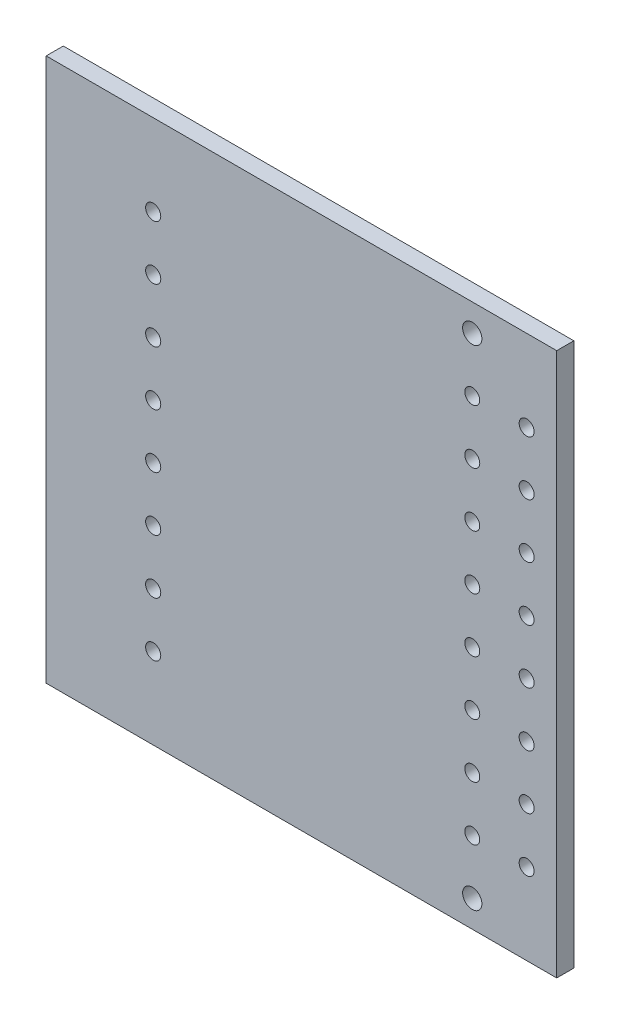
ISO-10303-21;
HEADER;
FILE_DESCRIPTION(('STEP AP214'),'2;1');
FILE_NAME('part.step','',(''),(''),'','','');
FILE_SCHEMA(('AUTOMOTIVE_DESIGN { 1 0 10303 214 1 1 1 1 }'));
ENDSEC;
DATA;
#1=APPLICATION_CONTEXT('core data for automotive mechanical design processes');
#2=APPLICATION_PROTOCOL_DEFINITION('international standard','automotive_design',2000,#1);
#3=PRODUCT_CONTEXT('',#1,'mechanical');
#4=PRODUCT('Part','Part','',(#3));
#5=PRODUCT_RELATED_PRODUCT_CATEGORY('part','',(#4));
#6=PRODUCT_DEFINITION_FORMATION('','',#4);
#7=PRODUCT_DEFINITION_CONTEXT('part definition',#1,'design');
#8=PRODUCT_DEFINITION('design','',#6,#7);
#9=PRODUCT_DEFINITION_SHAPE('','',#8);
#10=(LENGTH_UNIT() NAMED_UNIT(*) SI_UNIT(.MILLI.,.METRE.));
#11=(NAMED_UNIT(*) PLANE_ANGLE_UNIT() SI_UNIT($,.RADIAN.));
#12=(NAMED_UNIT(*) SI_UNIT($,.STERADIAN.) SOLID_ANGLE_UNIT());
#13=UNCERTAINTY_MEASURE_WITH_UNIT(LENGTH_MEASURE(1.E-05),#10,'distance_accuracy_value','');
#14=(GEOMETRIC_REPRESENTATION_CONTEXT(3) GLOBAL_UNCERTAINTY_ASSIGNED_CONTEXT((#13)) GLOBAL_UNIT_ASSIGNED_CONTEXT((#10,
#11,#12)) REPRESENTATION_CONTEXT('',''));
#15=CARTESIAN_POINT('',(0.,0.,0.));
#16=DIRECTION('',(0.,0.,1.));
#17=DIRECTION('',(1.,0.,0.));
#18=AXIS2_PLACEMENT_3D('',#15,#16,#17);
#19=CARTESIAN_POINT('',(0.,0.,1.6));
#20=DIRECTION('',(0.,0.,-1.));
#21=DIRECTION('',(-1.,0.,0.));
#22=AXIS2_PLACEMENT_3D('',#19,#20,#21);
#23=PLANE('',#22);
#24=CARTESIAN_POINT('',(-107.861418865346,-50.347158499177,1.6));
#25=DIRECTION('',(0.,0.,1.));
#26=DIRECTION('',(1.,0.,0.));
#27=AXIS2_PLACEMENT_3D('',#24,#25,#26);
#28=CIRCLE('',#27,0.89999999999999);
#29=CARTESIAN_POINT('',(-106.961418865346,-50.347158499177,1.6));
#30=VERTEX_POINT('',#29);
#31=EDGE_CURVE('E253',#30,#30,#28,.T.);
#32=ORIENTED_EDGE('',*,*,#31,.F.);
#33=EDGE_LOOP('',(#32));
#34=FACE_BOUND('',#33,.T.);
#35=CARTESIAN_POINT('',(-137.671418865346,-14.7871584991769,1.6));
#36=DIRECTION('',(0.,0.,1.));
#37=DIRECTION('',(1.,0.,0.));
#38=AXIS2_PLACEMENT_3D('',#35,#36,#37);
#39=CIRCLE('',#38,0.707106781188524);
#40=CARTESIAN_POINT('',(-136.964312084158,-14.7871584991769,1.6));
#41=VERTEX_POINT('',#40);
#42=EDGE_CURVE('E241',#41,#41,#39,.T.);
#43=ORIENTED_EDGE('',*,*,#42,.F.);
#44=EDGE_LOOP('',(#43));
#45=FACE_BOUND('',#44,.T.);
#46=CARTESIAN_POINT('',(-137.671418865346,-24.9471584991769,1.6));
#47=DIRECTION('',(0.,0.,1.));
#48=DIRECTION('',(1.,0.,0.));
#49=AXIS2_PLACEMENT_3D('',#46,#47,#48);
#50=CIRCLE('',#49,0.707106781188524);
#51=CARTESIAN_POINT('',(-136.964312084158,-24.9471584991769,1.6));
#52=VERTEX_POINT('',#51);
#53=EDGE_CURVE('E229',#52,#52,#50,.T.);
#54=ORIENTED_EDGE('',*,*,#53,.F.);
#55=EDGE_LOOP('',(#54));
#56=FACE_BOUND('',#55,.T.);
#57=CARTESIAN_POINT('',(-137.671418865346,-35.1071584991769,1.6));
#58=DIRECTION('',(0.,0.,1.));
#59=DIRECTION('',(1.,0.,0.));
#60=AXIS2_PLACEMENT_3D('',#57,#58,#59);
#61=CIRCLE('',#60,0.707106781188524);
#62=CARTESIAN_POINT('',(-136.964312084158,-35.1071584991769,1.6));
#63=VERTEX_POINT('',#62);
#64=EDGE_CURVE('E217',#63,#63,#61,.T.);
#65=ORIENTED_EDGE('',*,*,#64,.F.);
#66=EDGE_LOOP('',(#65));
#67=FACE_BOUND('',#66,.T.);
#68=CARTESIAN_POINT('',(-107.861418865346,-9.70715849917694,1.6));
#69=DIRECTION('',(0.,0.,1.));
#70=DIRECTION('',(1.,0.,0.));
#71=AXIS2_PLACEMENT_3D('',#68,#69,#70);
#72=CIRCLE('',#71,0.700000000000001);
#73=CARTESIAN_POINT('',(-107.161418865346,-9.70715849917694,1.6));
#74=VERTEX_POINT('',#73);
#75=EDGE_CURVE('E205',#74,#74,#72,.T.);
#76=ORIENTED_EDGE('',*,*,#75,.F.);
#77=EDGE_LOOP('',(#76));
#78=FACE_BOUND('',#77,.T.);
#79=CARTESIAN_POINT('',(-107.861418865346,-19.8671584991769,1.6));
#80=DIRECTION('',(0.,0.,1.));
#81=DIRECTION('',(1.,0.,0.));
#82=AXIS2_PLACEMENT_3D('',#79,#80,#81);
#83=CIRCLE('',#82,0.700000000000001);
#84=CARTESIAN_POINT('',(-107.161418865346,-19.8671584991769,1.6));
#85=VERTEX_POINT('',#84);
#86=EDGE_CURVE('E193',#85,#85,#83,.T.);
#87=ORIENTED_EDGE('',*,*,#86,.F.);
#88=EDGE_LOOP('',(#87));
#89=FACE_BOUND('',#88,.T.);
#90=CARTESIAN_POINT('',(-107.861418865346,-30.0271584991769,1.6));
#91=DIRECTION('',(0.,0.,1.));
#92=DIRECTION('',(1.,0.,0.));
#93=AXIS2_PLACEMENT_3D('',#90,#91,#92);
#94=CIRCLE('',#93,0.700000000000001);
#95=CARTESIAN_POINT('',(-107.161418865346,-30.0271584991769,1.6));
#96=VERTEX_POINT('',#95);
#97=EDGE_CURVE('E181',#96,#96,#94,.T.);
#98=ORIENTED_EDGE('',*,*,#97,.F.);
#99=EDGE_LOOP('',(#98));
#100=FACE_BOUND('',#99,.T.);
#101=CARTESIAN_POINT('',(-107.861418865346,-40.1871584991769,1.6));
#102=DIRECTION('',(0.,0.,1.));
#103=DIRECTION('',(1.,0.,0.));
#104=AXIS2_PLACEMENT_3D('',#101,#102,#103);
#105=CIRCLE('',#104,0.700000000000001);
#106=CARTESIAN_POINT('',(-107.161418865346,-40.1871584991769,1.6));
#107=VERTEX_POINT('',#106);
#108=EDGE_CURVE('E169',#107,#107,#105,.T.);
#109=ORIENTED_EDGE('',*,*,#108,.F.);
#110=EDGE_LOOP('',(#109));
#111=FACE_BOUND('',#110,.T.);
#112=CARTESIAN_POINT('',(-102.781418865346,-14.7871584991769,1.6));
#113=DIRECTION('',(0.,0.,1.));
#114=DIRECTION('',(1.,0.,0.));
#115=AXIS2_PLACEMENT_3D('',#112,#113,#114);
#116=CIRCLE('',#115,0.700000000000001);
#117=CARTESIAN_POINT('',(-102.081418865346,-14.7871584991769,1.6));
#118=VERTEX_POINT('',#117);
#119=EDGE_CURVE('E157',#118,#118,#116,.T.);
#120=ORIENTED_EDGE('',*,*,#119,.F.);
#121=EDGE_LOOP('',(#120));
#122=FACE_BOUND('',#121,.T.);
#123=CARTESIAN_POINT('',(-102.781418865346,-24.9471584991769,1.6));
#124=DIRECTION('',(0.,0.,1.));
#125=DIRECTION('',(1.,0.,0.));
#126=AXIS2_PLACEMENT_3D('',#123,#124,#125);
#127=CIRCLE('',#126,0.700000000000001);
#128=CARTESIAN_POINT('',(-102.081418865346,-24.9471584991769,1.6));
#129=VERTEX_POINT('',#128);
#130=EDGE_CURVE('E145',#129,#129,#127,.T.);
#131=ORIENTED_EDGE('',*,*,#130,.F.);
#132=EDGE_LOOP('',(#131));
#133=FACE_BOUND('',#132,.T.);
#134=CARTESIAN_POINT('',(-102.781418865346,-35.1071584991769,1.6));
#135=DIRECTION('',(0.,0.,1.));
#136=DIRECTION('',(1.,0.,0.));
#137=AXIS2_PLACEMENT_3D('',#134,#135,#136);
#138=CIRCLE('',#137,0.700000000000001);
#139=CARTESIAN_POINT('',(-102.081418865346,-35.1071584991769,1.6));
#140=VERTEX_POINT('',#139);
#141=EDGE_CURVE('E133',#140,#140,#138,.T.);
#142=ORIENTED_EDGE('',*,*,#141,.F.);
#143=EDGE_LOOP('',(#142));
#144=FACE_BOUND('',#143,.T.);
#145=CARTESIAN_POINT('',(-102.781418865346,-45.2671584991769,1.6));
#146=DIRECTION('',(0.,0.,1.));
#147=DIRECTION('',(1.,0.,0.));
#148=AXIS2_PLACEMENT_3D('',#145,#146,#147);
#149=CIRCLE('',#148,0.700000000000001);
#150=CARTESIAN_POINT('',(-102.081418865346,-45.2671584991769,1.6));
#151=VERTEX_POINT('',#150);
#152=EDGE_CURVE('E121',#151,#151,#149,.T.);
#153=ORIENTED_EDGE('',*,*,#152,.F.);
#154=EDGE_LOOP('',(#153));
#155=FACE_BOUND('',#154,.T.);
#156=CARTESIAN_POINT('',(-107.861418865346,-45.2671584991769,1.6));
#157=DIRECTION('',(0.,0.,1.));
#158=DIRECTION('',(1.,0.,0.));
#159=AXIS2_PLACEMENT_3D('',#156,#157,#158);
#160=CIRCLE('',#159,0.700000000000001);
#161=CARTESIAN_POINT('',(-107.161418865346,-45.2671584991769,1.6));
#162=VERTEX_POINT('',#161);
#163=EDGE_CURVE('E100',#162,#162,#160,.T.);
#164=ORIENTED_EDGE('',*,*,#163,.F.);
#165=EDGE_LOOP('',(#164));
#166=FACE_BOUND('',#165,.T.);
#167=DIRECTION('',(0.,-1.,0.));
#168=VECTOR('',#167,1.);
#169=CARTESIAN_POINT('',(-147.671418865346,-52.8471584991769,1.6));
#170=LINE('',#169,#168);
#171=CARTESIAN_POINT('',(-147.671418865346,-2.08715849917701,1.6));
#172=VERTEX_POINT('',#171);
#173=CARTESIAN_POINT('',(-147.671418865346,-52.8471584991769,1.6));
#174=VERTEX_POINT('',#173);
#175=EDGE_CURVE('E85',#172,#174,#170,.T.);
#176=ORIENTED_EDGE('',*,*,#175,.T.);
#177=DIRECTION('',(1.,0.,0.));
#178=VECTOR('',#177,1.);
#179=CARTESIAN_POINT('',(-147.671418865346,-52.8471584991769,1.6));
#180=LINE('',#179,#178);
#181=CARTESIAN_POINT('',(-99.9714173653461,-52.8471584991769,1.6));
#182=VERTEX_POINT('',#181);
#183=EDGE_CURVE('E80',#174,#182,#180,.T.);
#184=ORIENTED_EDGE('',*,*,#183,.T.);
#185=DIRECTION('',(0.,1.,0.));
#186=VECTOR('',#185,1.);
#187=CARTESIAN_POINT('',(-99.9714173653461,-52.8471584991769,1.6));
#188=LINE('',#187,#186);
#189=CARTESIAN_POINT('',(-99.9714173653461,-2.08715849917701,1.6));
#190=VERTEX_POINT('',#189);
#191=EDGE_CURVE('E83',#182,#190,#188,.T.);
#192=ORIENTED_EDGE('',*,*,#191,.T.);
#193=DIRECTION('',(-1.,0.,0.));
#194=VECTOR('',#193,1.);
#195=CARTESIAN_POINT('',(-147.671418865346,-2.08715849917701,1.6));
#196=LINE('',#195,#194);
#197=EDGE_CURVE('E50',#190,#172,#196,.T.);
#198=ORIENTED_EDGE('',*,*,#197,.T.);
#199=EDGE_LOOP('',(#176,#184,#192,#198));
#200=FACE_BOUND('',#199,.T.);
#201=CARTESIAN_POINT('',(-137.671418865346,-45.2671584991769,1.6));
#202=DIRECTION('',(0.,0.,1.));
#203=DIRECTION('',(1.,0.,0.));
#204=AXIS2_PLACEMENT_3D('',#201,#202,#203);
#205=CIRCLE('',#204,0.707106781188524);
#206=CARTESIAN_POINT('',(-136.964312084158,-45.2671584991769,1.6));
#207=VERTEX_POINT('',#206);
#208=EDGE_CURVE('E115',#207,#207,#205,.T.);
#209=ORIENTED_EDGE('',*,*,#208,.F.);
#210=EDGE_LOOP('',(#209));
#211=FACE_BOUND('',#210,.T.);
#212=CARTESIAN_POINT('',(-102.781418865346,-40.1871584991769,1.6));
#213=DIRECTION('',(0.,0.,1.));
#214=DIRECTION('',(1.,0.,0.));
#215=AXIS2_PLACEMENT_3D('',#212,#213,#214);
#216=CIRCLE('',#215,0.700000000000001);
#217=CARTESIAN_POINT('',(-102.081418865346,-40.1871584991769,1.6));
#218=VERTEX_POINT('',#217);
#219=EDGE_CURVE('E127',#218,#218,#216,.T.);
#220=ORIENTED_EDGE('',*,*,#219,.F.);
#221=EDGE_LOOP('',(#220));
#222=FACE_BOUND('',#221,.T.);
#223=CARTESIAN_POINT('',(-102.781418865346,-30.0271584991769,1.6));
#224=DIRECTION('',(0.,0.,1.));
#225=DIRECTION('',(1.,0.,0.));
#226=AXIS2_PLACEMENT_3D('',#223,#224,#225);
#227=CIRCLE('',#226,0.700000000000001);
#228=CARTESIAN_POINT('',(-102.081418865346,-30.0271584991769,1.6));
#229=VERTEX_POINT('',#228);
#230=EDGE_CURVE('E139',#229,#229,#227,.T.);
#231=ORIENTED_EDGE('',*,*,#230,.F.);
#232=EDGE_LOOP('',(#231));
#233=FACE_BOUND('',#232,.T.);
#234=CARTESIAN_POINT('',(-102.781418865346,-19.8671584991769,1.6));
#235=DIRECTION('',(0.,0.,1.));
#236=DIRECTION('',(1.,0.,0.));
#237=AXIS2_PLACEMENT_3D('',#234,#235,#236);
#238=CIRCLE('',#237,0.700000000000001);
#239=CARTESIAN_POINT('',(-102.081418865346,-19.8671584991769,1.6));
#240=VERTEX_POINT('',#239);
#241=EDGE_CURVE('E151',#240,#240,#238,.T.);
#242=ORIENTED_EDGE('',*,*,#241,.F.);
#243=EDGE_LOOP('',(#242));
#244=FACE_BOUND('',#243,.T.);
#245=CARTESIAN_POINT('',(-102.781418865346,-9.70715849917694,1.6));
#246=DIRECTION('',(0.,0.,1.));
#247=DIRECTION('',(1.,0.,0.));
#248=AXIS2_PLACEMENT_3D('',#245,#246,#247);
#249=CIRCLE('',#248,0.700000000000001);
#250=CARTESIAN_POINT('',(-102.081418865346,-9.70715849917694,1.6));
#251=VERTEX_POINT('',#250);
#252=EDGE_CURVE('E163',#251,#251,#249,.T.);
#253=ORIENTED_EDGE('',*,*,#252,.F.);
#254=EDGE_LOOP('',(#253));
#255=FACE_BOUND('',#254,.T.);
#256=CARTESIAN_POINT('',(-107.861418865346,-35.1071584991769,1.6));
#257=DIRECTION('',(0.,0.,1.));
#258=DIRECTION('',(1.,0.,0.));
#259=AXIS2_PLACEMENT_3D('',#256,#257,#258);
#260=CIRCLE('',#259,0.700000000000001);
#261=CARTESIAN_POINT('',(-107.161418865346,-35.1071584991769,1.6));
#262=VERTEX_POINT('',#261);
#263=EDGE_CURVE('E175',#262,#262,#260,.T.);
#264=ORIENTED_EDGE('',*,*,#263,.F.);
#265=EDGE_LOOP('',(#264));
#266=FACE_BOUND('',#265,.T.);
#267=CARTESIAN_POINT('',(-107.861418865346,-24.9471584991769,1.6));
#268=DIRECTION('',(0.,0.,1.));
#269=DIRECTION('',(1.,0.,0.));
#270=AXIS2_PLACEMENT_3D('',#267,#268,#269);
#271=CIRCLE('',#270,0.700000000000001);
#272=CARTESIAN_POINT('',(-107.161418865346,-24.9471584991769,1.6));
#273=VERTEX_POINT('',#272);
#274=EDGE_CURVE('E187',#273,#273,#271,.T.);
#275=ORIENTED_EDGE('',*,*,#274,.F.);
#276=EDGE_LOOP('',(#275));
#277=FACE_BOUND('',#276,.T.);
#278=CARTESIAN_POINT('',(-107.861418865346,-14.7871584991769,1.6));
#279=DIRECTION('',(0.,0.,1.));
#280=DIRECTION('',(1.,0.,0.));
#281=AXIS2_PLACEMENT_3D('',#278,#279,#280);
#282=CIRCLE('',#281,0.700000000000001);
#283=CARTESIAN_POINT('',(-107.161418865346,-14.7871584991769,1.6));
#284=VERTEX_POINT('',#283);
#285=EDGE_CURVE('E199',#284,#284,#282,.T.);
#286=ORIENTED_EDGE('',*,*,#285,.F.);
#287=EDGE_LOOP('',(#286));
#288=FACE_BOUND('',#287,.T.);
#289=CARTESIAN_POINT('',(-137.671418865346,-40.1871584991769,1.6));
#290=DIRECTION('',(0.,0.,1.));
#291=DIRECTION('',(1.,0.,0.));
#292=AXIS2_PLACEMENT_3D('',#289,#290,#291);
#293=CIRCLE('',#292,0.707106781188524);
#294=CARTESIAN_POINT('',(-136.964312084158,-40.1871584991769,1.6));
#295=VERTEX_POINT('',#294);
#296=EDGE_CURVE('E211',#295,#295,#293,.T.);
#297=ORIENTED_EDGE('',*,*,#296,.F.);
#298=EDGE_LOOP('',(#297));
#299=FACE_BOUND('',#298,.T.);
#300=CARTESIAN_POINT('',(-137.671418865346,-30.0271584991769,1.6));
#301=DIRECTION('',(0.,0.,1.));
#302=DIRECTION('',(1.,0.,0.));
#303=AXIS2_PLACEMENT_3D('',#300,#301,#302);
#304=CIRCLE('',#303,0.707106781188524);
#305=CARTESIAN_POINT('',(-136.964312084158,-30.0271584991769,1.6));
#306=VERTEX_POINT('',#305);
#307=EDGE_CURVE('E223',#306,#306,#304,.T.);
#308=ORIENTED_EDGE('',*,*,#307,.F.);
#309=EDGE_LOOP('',(#308));
#310=FACE_BOUND('',#309,.T.);
#311=CARTESIAN_POINT('',(-137.671418865346,-19.8671584991769,1.6));
#312=DIRECTION('',(0.,0.,1.));
#313=DIRECTION('',(1.,0.,0.));
#314=AXIS2_PLACEMENT_3D('',#311,#312,#313);
#315=CIRCLE('',#314,0.707106781188524);
#316=CARTESIAN_POINT('',(-136.964312084158,-19.8671584991769,1.6));
#317=VERTEX_POINT('',#316);
#318=EDGE_CURVE('E235',#317,#317,#315,.T.);
#319=ORIENTED_EDGE('',*,*,#318,.F.);
#320=EDGE_LOOP('',(#319));
#321=FACE_BOUND('',#320,.T.);
#322=CARTESIAN_POINT('',(-137.671418865346,-9.7071584991769,1.6));
#323=DIRECTION('',(0.,0.,1.));
#324=DIRECTION('',(1.,0.,0.));
#325=AXIS2_PLACEMENT_3D('',#322,#323,#324);
#326=CIRCLE('',#325,0.707106781188524);
#327=CARTESIAN_POINT('',(-136.964312084158,-9.7071584991769,1.6));
#328=VERTEX_POINT('',#327);
#329=EDGE_CURVE('E247',#328,#328,#326,.T.);
#330=ORIENTED_EDGE('',*,*,#329,.F.);
#331=EDGE_LOOP('',(#330));
#332=FACE_BOUND('',#331,.T.);
#333=CARTESIAN_POINT('',(-107.861418865346,-4.62715849917699,1.6));
#334=DIRECTION('',(0.,0.,1.));
#335=DIRECTION('',(1.,0.,0.));
#336=AXIS2_PLACEMENT_3D('',#333,#334,#335);
#337=CIRCLE('',#336,0.900000000000004);
#338=CARTESIAN_POINT('',(-106.961418865346,-4.62715849917699,1.6));
#339=VERTEX_POINT('',#338);
#340=EDGE_CURVE('E259',#339,#339,#337,.T.);
#341=ORIENTED_EDGE('',*,*,#340,.F.);
#342=EDGE_LOOP('',(#341));
#343=FACE_BOUND('',#342,.T.);
#344=ADVANCED_FACE('F33',(#34,#45,#56,#67,#78,#89,#100,#111,#122,#133,#144,#155,#166,#200,#211,
#222,#233,#244,#255,#266,#277,#288,#299,#310,#321,#332,#343),#23,.F.);
#345=CARTESIAN_POINT('',(0.,0.,0.));
#346=DIRECTION('',(0.,0.,-1.));
#347=DIRECTION('',(-1.,0.,0.));
#348=AXIS2_PLACEMENT_3D('',#345,#346,#347);
#349=PLANE('',#348);
#350=CARTESIAN_POINT('',(-107.861418865346,-50.347158499177,0.));
#351=DIRECTION('',(0.,0.,1.));
#352=DIRECTION('',(1.,0.,0.));
#353=AXIS2_PLACEMENT_3D('',#350,#351,#352);
#354=CIRCLE('',#353,0.89999999999999);
#355=CARTESIAN_POINT('',(-106.961418865346,-50.347158499177,0.));
#356=VERTEX_POINT('',#355);
#357=EDGE_CURVE('E256',#356,#356,#354,.T.);
#358=ORIENTED_EDGE('',*,*,#357,.T.);
#359=EDGE_LOOP('',(#358));
#360=FACE_BOUND('',#359,.T.);
#361=CARTESIAN_POINT('',(-137.671418865346,-14.7871584991769,0.));
#362=DIRECTION('',(0.,0.,1.));
#363=DIRECTION('',(1.,0.,0.));
#364=AXIS2_PLACEMENT_3D('',#361,#362,#363);
#365=CIRCLE('',#364,0.707106781188524);
#366=CARTESIAN_POINT('',(-136.964312084158,-14.7871584991769,0.));
#367=VERTEX_POINT('',#366);
#368=EDGE_CURVE('E244',#367,#367,#365,.T.);
#369=ORIENTED_EDGE('',*,*,#368,.T.);
#370=EDGE_LOOP('',(#369));
#371=FACE_BOUND('',#370,.T.);
#372=CARTESIAN_POINT('',(-137.671418865346,-24.9471584991769,0.));
#373=DIRECTION('',(0.,0.,1.));
#374=DIRECTION('',(1.,0.,0.));
#375=AXIS2_PLACEMENT_3D('',#372,#373,#374);
#376=CIRCLE('',#375,0.707106781188524);
#377=CARTESIAN_POINT('',(-136.964312084158,-24.9471584991769,0.));
#378=VERTEX_POINT('',#377);
#379=EDGE_CURVE('E232',#378,#378,#376,.T.);
#380=ORIENTED_EDGE('',*,*,#379,.T.);
#381=EDGE_LOOP('',(#380));
#382=FACE_BOUND('',#381,.T.);
#383=CARTESIAN_POINT('',(-137.671418865346,-35.1071584991769,0.));
#384=DIRECTION('',(0.,0.,1.));
#385=DIRECTION('',(1.,0.,0.));
#386=AXIS2_PLACEMENT_3D('',#383,#384,#385);
#387=CIRCLE('',#386,0.707106781188524);
#388=CARTESIAN_POINT('',(-136.964312084158,-35.1071584991769,0.));
#389=VERTEX_POINT('',#388);
#390=EDGE_CURVE('E220',#389,#389,#387,.T.);
#391=ORIENTED_EDGE('',*,*,#390,.T.);
#392=EDGE_LOOP('',(#391));
#393=FACE_BOUND('',#392,.T.);
#394=CARTESIAN_POINT('',(-107.861418865346,-9.70715849917694,0.));
#395=DIRECTION('',(0.,0.,1.));
#396=DIRECTION('',(1.,0.,0.));
#397=AXIS2_PLACEMENT_3D('',#394,#395,#396);
#398=CIRCLE('',#397,0.700000000000001);
#399=CARTESIAN_POINT('',(-107.161418865346,-9.70715849917694,0.));
#400=VERTEX_POINT('',#399);
#401=EDGE_CURVE('E208',#400,#400,#398,.T.);
#402=ORIENTED_EDGE('',*,*,#401,.T.);
#403=EDGE_LOOP('',(#402));
#404=FACE_BOUND('',#403,.T.);
#405=CARTESIAN_POINT('',(-107.861418865346,-19.8671584991769,0.));
#406=DIRECTION('',(0.,0.,1.));
#407=DIRECTION('',(1.,0.,0.));
#408=AXIS2_PLACEMENT_3D('',#405,#406,#407);
#409=CIRCLE('',#408,0.700000000000001);
#410=CARTESIAN_POINT('',(-107.161418865346,-19.8671584991769,0.));
#411=VERTEX_POINT('',#410);
#412=EDGE_CURVE('E196',#411,#411,#409,.T.);
#413=ORIENTED_EDGE('',*,*,#412,.T.);
#414=EDGE_LOOP('',(#413));
#415=FACE_BOUND('',#414,.T.);
#416=CARTESIAN_POINT('',(-107.861418865346,-30.0271584991769,0.));
#417=DIRECTION('',(0.,0.,1.));
#418=DIRECTION('',(1.,0.,0.));
#419=AXIS2_PLACEMENT_3D('',#416,#417,#418);
#420=CIRCLE('',#419,0.700000000000001);
#421=CARTESIAN_POINT('',(-107.161418865346,-30.0271584991769,0.));
#422=VERTEX_POINT('',#421);
#423=EDGE_CURVE('E184',#422,#422,#420,.T.);
#424=ORIENTED_EDGE('',*,*,#423,.T.);
#425=EDGE_LOOP('',(#424));
#426=FACE_BOUND('',#425,.T.);
#427=CARTESIAN_POINT('',(-107.861418865346,-40.1871584991769,0.));
#428=DIRECTION('',(0.,0.,1.));
#429=DIRECTION('',(1.,0.,0.));
#430=AXIS2_PLACEMENT_3D('',#427,#428,#429);
#431=CIRCLE('',#430,0.700000000000001);
#432=CARTESIAN_POINT('',(-107.161418865346,-40.1871584991769,0.));
#433=VERTEX_POINT('',#432);
#434=EDGE_CURVE('E172',#433,#433,#431,.T.);
#435=ORIENTED_EDGE('',*,*,#434,.T.);
#436=EDGE_LOOP('',(#435));
#437=FACE_BOUND('',#436,.T.);
#438=CARTESIAN_POINT('',(-102.781418865346,-14.7871584991769,0.));
#439=DIRECTION('',(0.,0.,1.));
#440=DIRECTION('',(1.,0.,0.));
#441=AXIS2_PLACEMENT_3D('',#438,#439,#440);
#442=CIRCLE('',#441,0.700000000000001);
#443=CARTESIAN_POINT('',(-102.081418865346,-14.7871584991769,0.));
#444=VERTEX_POINT('',#443);
#445=EDGE_CURVE('E160',#444,#444,#442,.T.);
#446=ORIENTED_EDGE('',*,*,#445,.T.);
#447=EDGE_LOOP('',(#446));
#448=FACE_BOUND('',#447,.T.);
#449=CARTESIAN_POINT('',(-102.781418865346,-24.9471584991769,0.));
#450=DIRECTION('',(0.,0.,1.));
#451=DIRECTION('',(1.,0.,0.));
#452=AXIS2_PLACEMENT_3D('',#449,#450,#451);
#453=CIRCLE('',#452,0.700000000000001);
#454=CARTESIAN_POINT('',(-102.081418865346,-24.9471584991769,0.));
#455=VERTEX_POINT('',#454);
#456=EDGE_CURVE('E148',#455,#455,#453,.T.);
#457=ORIENTED_EDGE('',*,*,#456,.T.);
#458=EDGE_LOOP('',(#457));
#459=FACE_BOUND('',#458,.T.);
#460=CARTESIAN_POINT('',(-102.781418865346,-35.1071584991769,0.));
#461=DIRECTION('',(0.,0.,1.));
#462=DIRECTION('',(1.,0.,0.));
#463=AXIS2_PLACEMENT_3D('',#460,#461,#462);
#464=CIRCLE('',#463,0.700000000000001);
#465=CARTESIAN_POINT('',(-102.081418865346,-35.1071584991769,0.));
#466=VERTEX_POINT('',#465);
#467=EDGE_CURVE('E136',#466,#466,#464,.T.);
#468=ORIENTED_EDGE('',*,*,#467,.T.);
#469=EDGE_LOOP('',(#468));
#470=FACE_BOUND('',#469,.T.);
#471=CARTESIAN_POINT('',(-102.781418865346,-45.2671584991769,0.));
#472=DIRECTION('',(0.,0.,1.));
#473=DIRECTION('',(1.,0.,0.));
#474=AXIS2_PLACEMENT_3D('',#471,#472,#473);
#475=CIRCLE('',#474,0.700000000000001);
#476=CARTESIAN_POINT('',(-102.081418865346,-45.2671584991769,0.));
#477=VERTEX_POINT('',#476);
#478=EDGE_CURVE('E124',#477,#477,#475,.T.);
#479=ORIENTED_EDGE('',*,*,#478,.T.);
#480=EDGE_LOOP('',(#479));
#481=FACE_BOUND('',#480,.T.);
#482=CARTESIAN_POINT('',(-107.861418865346,-45.2671584991769,0.));
#483=DIRECTION('',(0.,0.,1.));
#484=DIRECTION('',(1.,0.,0.));
#485=AXIS2_PLACEMENT_3D('',#482,#483,#484);
#486=CIRCLE('',#485,0.700000000000001);
#487=CARTESIAN_POINT('',(-107.161418865346,-45.2671584991769,0.));
#488=VERTEX_POINT('',#487);
#489=EDGE_CURVE('E112',#488,#488,#486,.T.);
#490=ORIENTED_EDGE('',*,*,#489,.T.);
#491=EDGE_LOOP('',(#490));
#492=FACE_BOUND('',#491,.T.);
#493=DIRECTION('',(0.,-1.,0.));
#494=VECTOR('',#493,1.);
#495=CARTESIAN_POINT('',(-147.671418865346,-52.8471584991769,0.));
#496=LINE('',#495,#494);
#497=CARTESIAN_POINT('',(-147.671418865346,-2.08715849917701,0.));
#498=VERTEX_POINT('',#497);
#499=CARTESIAN_POINT('',(-147.671418865346,-52.8471584991769,0.));
#500=VERTEX_POINT('',#499);
#501=EDGE_CURVE('E97',#498,#500,#496,.T.);
#502=ORIENTED_EDGE('',*,*,#501,.F.);
#503=DIRECTION('',(-1.,0.,0.));
#504=VECTOR('',#503,1.);
#505=CARTESIAN_POINT('',(-147.671418865346,-2.08715849917701,0.));
#506=LINE('',#505,#504);
#507=CARTESIAN_POINT('',(-99.9714173653461,-2.08715849917701,0.));
#508=VERTEX_POINT('',#507);
#509=EDGE_CURVE('E73',#508,#498,#506,.T.);
#510=ORIENTED_EDGE('',*,*,#509,.F.);
#511=DIRECTION('',(0.,1.,0.));
#512=VECTOR('',#511,1.);
#513=CARTESIAN_POINT('',(-99.9714173653461,-52.8471584991769,0.));
#514=LINE('',#513,#512);
#515=CARTESIAN_POINT('',(-99.9714173653461,-52.8471584991769,0.));
#516=VERTEX_POINT('',#515);
#517=EDGE_CURVE('E67',#516,#508,#514,.T.);
#518=ORIENTED_EDGE('',*,*,#517,.F.);
#519=DIRECTION('',(1.,0.,0.));
#520=VECTOR('',#519,1.);
#521=CARTESIAN_POINT('',(-147.671418865346,-52.8471584991769,0.));
#522=LINE('',#521,#520);
#523=EDGE_CURVE('E89',#500,#516,#522,.T.);
#524=ORIENTED_EDGE('',*,*,#523,.F.);
#525=EDGE_LOOP('',(#502,#510,#518,#524));
#526=FACE_BOUND('',#525,.T.);
#527=CARTESIAN_POINT('',(-137.671418865346,-45.2671584991769,0.));
#528=DIRECTION('',(0.,0.,1.));
#529=DIRECTION('',(1.,0.,0.));
#530=AXIS2_PLACEMENT_3D('',#527,#528,#529);
#531=CIRCLE('',#530,0.707106781188524);
#532=CARTESIAN_POINT('',(-136.964312084158,-45.2671584991769,0.));
#533=VERTEX_POINT('',#532);
#534=EDGE_CURVE('E118',#533,#533,#531,.T.);
#535=ORIENTED_EDGE('',*,*,#534,.T.);
#536=EDGE_LOOP('',(#535));
#537=FACE_BOUND('',#536,.T.);
#538=CARTESIAN_POINT('',(-102.781418865346,-40.1871584991769,0.));
#539=DIRECTION('',(0.,0.,1.));
#540=DIRECTION('',(1.,0.,0.));
#541=AXIS2_PLACEMENT_3D('',#538,#539,#540);
#542=CIRCLE('',#541,0.700000000000001);
#543=CARTESIAN_POINT('',(-102.081418865346,-40.1871584991769,0.));
#544=VERTEX_POINT('',#543);
#545=EDGE_CURVE('E130',#544,#544,#542,.T.);
#546=ORIENTED_EDGE('',*,*,#545,.T.);
#547=EDGE_LOOP('',(#546));
#548=FACE_BOUND('',#547,.T.);
#549=CARTESIAN_POINT('',(-102.781418865346,-30.0271584991769,0.));
#550=DIRECTION('',(0.,0.,1.));
#551=DIRECTION('',(1.,0.,0.));
#552=AXIS2_PLACEMENT_3D('',#549,#550,#551);
#553=CIRCLE('',#552,0.700000000000001);
#554=CARTESIAN_POINT('',(-102.081418865346,-30.0271584991769,0.));
#555=VERTEX_POINT('',#554);
#556=EDGE_CURVE('E142',#555,#555,#553,.T.);
#557=ORIENTED_EDGE('',*,*,#556,.T.);
#558=EDGE_LOOP('',(#557));
#559=FACE_BOUND('',#558,.T.);
#560=CARTESIAN_POINT('',(-102.781418865346,-19.8671584991769,0.));
#561=DIRECTION('',(0.,0.,1.));
#562=DIRECTION('',(1.,0.,0.));
#563=AXIS2_PLACEMENT_3D('',#560,#561,#562);
#564=CIRCLE('',#563,0.700000000000001);
#565=CARTESIAN_POINT('',(-102.081418865346,-19.8671584991769,0.));
#566=VERTEX_POINT('',#565);
#567=EDGE_CURVE('E154',#566,#566,#564,.T.);
#568=ORIENTED_EDGE('',*,*,#567,.T.);
#569=EDGE_LOOP('',(#568));
#570=FACE_BOUND('',#569,.T.);
#571=CARTESIAN_POINT('',(-102.781418865346,-9.70715849917694,0.));
#572=DIRECTION('',(0.,0.,1.));
#573=DIRECTION('',(1.,0.,0.));
#574=AXIS2_PLACEMENT_3D('',#571,#572,#573);
#575=CIRCLE('',#574,0.700000000000001);
#576=CARTESIAN_POINT('',(-102.081418865346,-9.70715849917694,0.));
#577=VERTEX_POINT('',#576);
#578=EDGE_CURVE('E166',#577,#577,#575,.T.);
#579=ORIENTED_EDGE('',*,*,#578,.T.);
#580=EDGE_LOOP('',(#579));
#581=FACE_BOUND('',#580,.T.);
#582=CARTESIAN_POINT('',(-107.861418865346,-35.1071584991769,0.));
#583=DIRECTION('',(0.,0.,1.));
#584=DIRECTION('',(1.,0.,0.));
#585=AXIS2_PLACEMENT_3D('',#582,#583,#584);
#586=CIRCLE('',#585,0.700000000000001);
#587=CARTESIAN_POINT('',(-107.161418865346,-35.1071584991769,0.));
#588=VERTEX_POINT('',#587);
#589=EDGE_CURVE('E178',#588,#588,#586,.T.);
#590=ORIENTED_EDGE('',*,*,#589,.T.);
#591=EDGE_LOOP('',(#590));
#592=FACE_BOUND('',#591,.T.);
#593=CARTESIAN_POINT('',(-107.861418865346,-24.9471584991769,0.));
#594=DIRECTION('',(0.,0.,1.));
#595=DIRECTION('',(1.,0.,0.));
#596=AXIS2_PLACEMENT_3D('',#593,#594,#595);
#597=CIRCLE('',#596,0.700000000000001);
#598=CARTESIAN_POINT('',(-107.161418865346,-24.9471584991769,0.));
#599=VERTEX_POINT('',#598);
#600=EDGE_CURVE('E190',#599,#599,#597,.T.);
#601=ORIENTED_EDGE('',*,*,#600,.T.);
#602=EDGE_LOOP('',(#601));
#603=FACE_BOUND('',#602,.T.);
#604=CARTESIAN_POINT('',(-107.861418865346,-14.7871584991769,0.));
#605=DIRECTION('',(0.,0.,1.));
#606=DIRECTION('',(1.,0.,0.));
#607=AXIS2_PLACEMENT_3D('',#604,#605,#606);
#608=CIRCLE('',#607,0.700000000000001);
#609=CARTESIAN_POINT('',(-107.161418865346,-14.7871584991769,0.));
#610=VERTEX_POINT('',#609);
#611=EDGE_CURVE('E202',#610,#610,#608,.T.);
#612=ORIENTED_EDGE('',*,*,#611,.T.);
#613=EDGE_LOOP('',(#612));
#614=FACE_BOUND('',#613,.T.);
#615=CARTESIAN_POINT('',(-137.671418865346,-40.1871584991769,0.));
#616=DIRECTION('',(0.,0.,1.));
#617=DIRECTION('',(1.,0.,0.));
#618=AXIS2_PLACEMENT_3D('',#615,#616,#617);
#619=CIRCLE('',#618,0.707106781188524);
#620=CARTESIAN_POINT('',(-136.964312084158,-40.1871584991769,0.));
#621=VERTEX_POINT('',#620);
#622=EDGE_CURVE('E214',#621,#621,#619,.T.);
#623=ORIENTED_EDGE('',*,*,#622,.T.);
#624=EDGE_LOOP('',(#623));
#625=FACE_BOUND('',#624,.T.);
#626=CARTESIAN_POINT('',(-137.671418865346,-30.0271584991769,0.));
#627=DIRECTION('',(0.,0.,1.));
#628=DIRECTION('',(1.,0.,0.));
#629=AXIS2_PLACEMENT_3D('',#626,#627,#628);
#630=CIRCLE('',#629,0.707106781188524);
#631=CARTESIAN_POINT('',(-136.964312084158,-30.0271584991769,0.));
#632=VERTEX_POINT('',#631);
#633=EDGE_CURVE('E226',#632,#632,#630,.T.);
#634=ORIENTED_EDGE('',*,*,#633,.T.);
#635=EDGE_LOOP('',(#634));
#636=FACE_BOUND('',#635,.T.);
#637=CARTESIAN_POINT('',(-137.671418865346,-19.8671584991769,0.));
#638=DIRECTION('',(0.,0.,1.));
#639=DIRECTION('',(1.,0.,0.));
#640=AXIS2_PLACEMENT_3D('',#637,#638,#639);
#641=CIRCLE('',#640,0.707106781188524);
#642=CARTESIAN_POINT('',(-136.964312084158,-19.8671584991769,0.));
#643=VERTEX_POINT('',#642);
#644=EDGE_CURVE('E238',#643,#643,#641,.T.);
#645=ORIENTED_EDGE('',*,*,#644,.T.);
#646=EDGE_LOOP('',(#645));
#647=FACE_BOUND('',#646,.T.);
#648=CARTESIAN_POINT('',(-137.671418865346,-9.7071584991769,0.));
#649=DIRECTION('',(0.,0.,1.));
#650=DIRECTION('',(1.,0.,0.));
#651=AXIS2_PLACEMENT_3D('',#648,#649,#650);
#652=CIRCLE('',#651,0.707106781188524);
#653=CARTESIAN_POINT('',(-136.964312084158,-9.7071584991769,0.));
#654=VERTEX_POINT('',#653);
#655=EDGE_CURVE('E250',#654,#654,#652,.T.);
#656=ORIENTED_EDGE('',*,*,#655,.T.);
#657=EDGE_LOOP('',(#656));
#658=FACE_BOUND('',#657,.T.);
#659=CARTESIAN_POINT('',(-107.861418865346,-4.62715849917699,0.));
#660=DIRECTION('',(0.,0.,1.));
#661=DIRECTION('',(1.,0.,0.));
#662=AXIS2_PLACEMENT_3D('',#659,#660,#661);
#663=CIRCLE('',#662,0.900000000000004);
#664=CARTESIAN_POINT('',(-106.961418865346,-4.62715849917699,0.));
#665=VERTEX_POINT('',#664);
#666=EDGE_CURVE('E262',#665,#665,#663,.T.);
#667=ORIENTED_EDGE('',*,*,#666,.T.);
#668=EDGE_LOOP('',(#667));
#669=FACE_BOUND('',#668,.T.);
#670=ADVANCED_FACE('F108',(#360,#371,#382,#393,#404,#415,#426,#437,#448,#459,#470,#481,#492,
#526,#537,#548,#559,#570,#581,#592,#603,#614,#625,#636,#647,#658,#669),#349,.T.);
#671=CARTESIAN_POINT('',(-147.671418865346,-52.8471584991769,1.6));
#672=DIRECTION('',(1.,0.,0.));
#673=DIRECTION('',(0.,0.,-1.));
#674=AXIS2_PLACEMENT_3D('',#671,#672,#673);
#675=PLANE('',#674);
#676=ORIENTED_EDGE('',*,*,#501,.T.);
#677=DIRECTION('',(0.,0.,-1.));
#678=VECTOR('',#677,1.);
#679=CARTESIAN_POINT('',(-147.671418865346,-52.8471584991769,1.6));
#680=LINE('',#679,#678);
#681=EDGE_CURVE('E11',#174,#500,#680,.T.);
#682=ORIENTED_EDGE('',*,*,#681,.F.);
#683=ORIENTED_EDGE('',*,*,#175,.F.);
#684=DIRECTION('',(0.,0.,-1.));
#685=VECTOR('',#684,1.);
#686=CARTESIAN_POINT('',(-147.671418865346,-2.08715849917701,1.6));
#687=LINE('',#686,#685);
#688=EDGE_CURVE('E93',#172,#498,#687,.T.);
#689=ORIENTED_EDGE('',*,*,#688,.T.);
#690=EDGE_LOOP('',(#676,#682,#683,#689));
#691=FACE_BOUND('',#690,.T.);
#692=ADVANCED_FACE('F35',(#691),#675,.F.);
#693=CARTESIAN_POINT('',(-147.671418865346,-52.8471584991769,1.6));
#694=DIRECTION('',(0.,1.,0.));
#695=DIRECTION('',(0.,0.,1.));
#696=AXIS2_PLACEMENT_3D('',#693,#694,#695);
#697=PLANE('',#696);
#698=ORIENTED_EDGE('',*,*,#523,.T.);
#699=DIRECTION('',(0.,0.,-1.));
#700=VECTOR('',#699,1.);
#701=CARTESIAN_POINT('',(-99.9714173653461,-52.8471584991769,1.6));
#702=LINE('',#701,#700);
#703=EDGE_CURVE('E42',#182,#516,#702,.T.);
#704=ORIENTED_EDGE('',*,*,#703,.F.);
#705=ORIENTED_EDGE('',*,*,#183,.F.);
#706=ORIENTED_EDGE('',*,*,#681,.T.);
#707=EDGE_LOOP('',(#698,#704,#705,#706));
#708=FACE_BOUND('',#707,.T.);
#709=ADVANCED_FACE('F88',(#708),#697,.F.);
#710=CARTESIAN_POINT('',(-99.9714173653461,-52.8471584991769,1.6));
#711=DIRECTION('',(-1.,0.,0.));
#712=DIRECTION('',(0.,0.,1.));
#713=AXIS2_PLACEMENT_3D('',#710,#711,#712);
#714=PLANE('',#713);
#715=ORIENTED_EDGE('',*,*,#517,.T.);
#716=DIRECTION('',(0.,0.,-1.));
#717=VECTOR('',#716,1.);
#718=CARTESIAN_POINT('',(-99.9714173653461,-2.08715849917701,1.6));
#719=LINE('',#718,#717);
#720=EDGE_CURVE('E90',#190,#508,#719,.T.);
#721=ORIENTED_EDGE('',*,*,#720,.F.);
#722=ORIENTED_EDGE('',*,*,#191,.F.);
#723=ORIENTED_EDGE('',*,*,#703,.T.);
#724=EDGE_LOOP('',(#715,#721,#722,#723));
#725=FACE_BOUND('',#724,.T.);
#726=ADVANCED_FACE('F91',(#725),#714,.F.);
#727=CARTESIAN_POINT('',(-147.671418865346,-2.08715849917701,1.6));
#728=DIRECTION('',(0.,-1.,0.));
#729=DIRECTION('',(0.,0.,-1.));
#730=AXIS2_PLACEMENT_3D('',#727,#728,#729);
#731=PLANE('',#730);
#732=ORIENTED_EDGE('',*,*,#509,.T.);
#733=ORIENTED_EDGE('',*,*,#688,.F.);
#734=ORIENTED_EDGE('',*,*,#197,.F.);
#735=ORIENTED_EDGE('',*,*,#720,.T.);
#736=EDGE_LOOP('',(#732,#733,#734,#735));
#737=FACE_BOUND('',#736,.T.);
#738=ADVANCED_FACE('F105',(#737),#731,.F.);
#739=CARTESIAN_POINT('',(-107.861418865346,-45.2671584991769,1.6));
#740=DIRECTION('',(0.,0.,-1.));
#741=DIRECTION('',(-1.,0.,0.));
#742=AXIS2_PLACEMENT_3D('',#739,#740,#741);
#743=CYLINDRICAL_SURFACE('',#742,0.700000000000001);
#744=ORIENTED_EDGE('',*,*,#163,.T.);
#745=EDGE_LOOP('',(#744));
#746=FACE_BOUND('',#745,.T.);
#747=ORIENTED_EDGE('',*,*,#489,.F.);
#748=EDGE_LOOP('',(#747));
#749=FACE_BOUND('',#748,.T.);
#750=ADVANCED_FACE('F282',(#746,#749),#743,.F.);
#751=CARTESIAN_POINT('',(-137.671418865346,-45.2671584991769,1.6));
#752=DIRECTION('',(0.,0.,-1.));
#753=DIRECTION('',(-1.,0.,0.));
#754=AXIS2_PLACEMENT_3D('',#751,#752,#753);
#755=CYLINDRICAL_SURFACE('',#754,0.707106781188524);
#756=ORIENTED_EDGE('',*,*,#208,.T.);
#757=EDGE_LOOP('',(#756));
#758=FACE_BOUND('',#757,.T.);
#759=ORIENTED_EDGE('',*,*,#534,.F.);
#760=EDGE_LOOP('',(#759));
#761=FACE_BOUND('',#760,.T.);
#762=ADVANCED_FACE('F328',(#758,#761),#755,.F.);
#763=CARTESIAN_POINT('',(-102.781418865346,-45.2671584991769,1.6));
#764=DIRECTION('',(0.,0.,-1.));
#765=DIRECTION('',(-1.,0.,0.));
#766=AXIS2_PLACEMENT_3D('',#763,#764,#765);
#767=CYLINDRICAL_SURFACE('',#766,0.700000000000001);
#768=ORIENTED_EDGE('',*,*,#152,.T.);
#769=EDGE_LOOP('',(#768));
#770=FACE_BOUND('',#769,.T.);
#771=ORIENTED_EDGE('',*,*,#478,.F.);
#772=EDGE_LOOP('',(#771));
#773=FACE_BOUND('',#772,.T.);
#774=ADVANCED_FACE('F336',(#770,#773),#767,.F.);
#775=CARTESIAN_POINT('',(-102.781418865346,-40.1871584991769,1.6));
#776=DIRECTION('',(0.,0.,-1.));
#777=DIRECTION('',(-1.,0.,0.));
#778=AXIS2_PLACEMENT_3D('',#775,#776,#777);
#779=CYLINDRICAL_SURFACE('',#778,0.700000000000001);
#780=ORIENTED_EDGE('',*,*,#219,.T.);
#781=EDGE_LOOP('',(#780));
#782=FACE_BOUND('',#781,.T.);
#783=ORIENTED_EDGE('',*,*,#545,.F.);
#784=EDGE_LOOP('',(#783));
#785=FACE_BOUND('',#784,.T.);
#786=ADVANCED_FACE('F344',(#782,#785),#779,.F.);
#787=CARTESIAN_POINT('',(-102.781418865346,-35.1071584991769,1.6));
#788=DIRECTION('',(0.,0.,-1.));
#789=DIRECTION('',(-1.,0.,0.));
#790=AXIS2_PLACEMENT_3D('',#787,#788,#789);
#791=CYLINDRICAL_SURFACE('',#790,0.700000000000001);
#792=ORIENTED_EDGE('',*,*,#141,.T.);
#793=EDGE_LOOP('',(#792));
#794=FACE_BOUND('',#793,.T.);
#795=ORIENTED_EDGE('',*,*,#467,.F.);
#796=EDGE_LOOP('',(#795));
#797=FACE_BOUND('',#796,.T.);
#798=ADVANCED_FACE('F353',(#794,#797),#791,.F.);
#799=CARTESIAN_POINT('',(-102.781418865346,-30.0271584991769,1.6));
#800=DIRECTION('',(0.,0.,-1.));
#801=DIRECTION('',(-1.,0.,0.));
#802=AXIS2_PLACEMENT_3D('',#799,#800,#801);
#803=CYLINDRICAL_SURFACE('',#802,0.700000000000001);
#804=ORIENTED_EDGE('',*,*,#230,.T.);
#805=EDGE_LOOP('',(#804));
#806=FACE_BOUND('',#805,.T.);
#807=ORIENTED_EDGE('',*,*,#556,.F.);
#808=EDGE_LOOP('',(#807));
#809=FACE_BOUND('',#808,.T.);
#810=ADVANCED_FACE('F362',(#806,#809),#803,.F.);
#811=CARTESIAN_POINT('',(-102.781418865346,-24.9471584991769,1.6));
#812=DIRECTION('',(0.,0.,-1.));
#813=DIRECTION('',(-1.,0.,0.));
#814=AXIS2_PLACEMENT_3D('',#811,#812,#813);
#815=CYLINDRICAL_SURFACE('',#814,0.700000000000001);
#816=ORIENTED_EDGE('',*,*,#130,.T.);
#817=EDGE_LOOP('',(#816));
#818=FACE_BOUND('',#817,.T.);
#819=ORIENTED_EDGE('',*,*,#456,.F.);
#820=EDGE_LOOP('',(#819));
#821=FACE_BOUND('',#820,.T.);
#822=ADVANCED_FACE('F371',(#818,#821),#815,.F.);
#823=CARTESIAN_POINT('',(-102.781418865346,-19.8671584991769,1.6));
#824=DIRECTION('',(0.,0.,-1.));
#825=DIRECTION('',(-1.,0.,0.));
#826=AXIS2_PLACEMENT_3D('',#823,#824,#825);
#827=CYLINDRICAL_SURFACE('',#826,0.700000000000001);
#828=ORIENTED_EDGE('',*,*,#241,.T.);
#829=EDGE_LOOP('',(#828));
#830=FACE_BOUND('',#829,.T.);
#831=ORIENTED_EDGE('',*,*,#567,.F.);
#832=EDGE_LOOP('',(#831));
#833=FACE_BOUND('',#832,.T.);
#834=ADVANCED_FACE('F380',(#830,#833),#827,.F.);
#835=CARTESIAN_POINT('',(-102.781418865346,-14.7871584991769,1.6));
#836=DIRECTION('',(0.,0.,-1.));
#837=DIRECTION('',(-1.,0.,0.));
#838=AXIS2_PLACEMENT_3D('',#835,#836,#837);
#839=CYLINDRICAL_SURFACE('',#838,0.700000000000001);
#840=ORIENTED_EDGE('',*,*,#119,.T.);
#841=EDGE_LOOP('',(#840));
#842=FACE_BOUND('',#841,.T.);
#843=ORIENTED_EDGE('',*,*,#445,.F.);
#844=EDGE_LOOP('',(#843));
#845=FACE_BOUND('',#844,.T.);
#846=ADVANCED_FACE('F389',(#842,#845),#839,.F.);
#847=CARTESIAN_POINT('',(-102.781418865346,-9.70715849917694,1.6));
#848=DIRECTION('',(0.,0.,-1.));
#849=DIRECTION('',(-1.,0.,0.));
#850=AXIS2_PLACEMENT_3D('',#847,#848,#849);
#851=CYLINDRICAL_SURFACE('',#850,0.700000000000001);
#852=ORIENTED_EDGE('',*,*,#252,.T.);
#853=EDGE_LOOP('',(#852));
#854=FACE_BOUND('',#853,.T.);
#855=ORIENTED_EDGE('',*,*,#578,.F.);
#856=EDGE_LOOP('',(#855));
#857=FACE_BOUND('',#856,.T.);
#858=ADVANCED_FACE('F398',(#854,#857),#851,.F.);
#859=CARTESIAN_POINT('',(-107.861418865346,-40.1871584991769,1.6));
#860=DIRECTION('',(0.,0.,-1.));
#861=DIRECTION('',(-1.,0.,0.));
#862=AXIS2_PLACEMENT_3D('',#859,#860,#861);
#863=CYLINDRICAL_SURFACE('',#862,0.700000000000001);
#864=ORIENTED_EDGE('',*,*,#108,.T.);
#865=EDGE_LOOP('',(#864));
#866=FACE_BOUND('',#865,.T.);
#867=ORIENTED_EDGE('',*,*,#434,.F.);
#868=EDGE_LOOP('',(#867));
#869=FACE_BOUND('',#868,.T.);
#870=ADVANCED_FACE('F407',(#866,#869),#863,.F.);
#871=CARTESIAN_POINT('',(-107.861418865346,-35.1071584991769,1.6));
#872=DIRECTION('',(0.,0.,-1.));
#873=DIRECTION('',(-1.,0.,0.));
#874=AXIS2_PLACEMENT_3D('',#871,#872,#873);
#875=CYLINDRICAL_SURFACE('',#874,0.700000000000001);
#876=ORIENTED_EDGE('',*,*,#263,.T.);
#877=EDGE_LOOP('',(#876));
#878=FACE_BOUND('',#877,.T.);
#879=ORIENTED_EDGE('',*,*,#589,.F.);
#880=EDGE_LOOP('',(#879));
#881=FACE_BOUND('',#880,.T.);
#882=ADVANCED_FACE('F416',(#878,#881),#875,.F.);
#883=CARTESIAN_POINT('',(-107.861418865346,-30.0271584991769,1.6));
#884=DIRECTION('',(0.,0.,-1.));
#885=DIRECTION('',(-1.,0.,0.));
#886=AXIS2_PLACEMENT_3D('',#883,#884,#885);
#887=CYLINDRICAL_SURFACE('',#886,0.700000000000001);
#888=ORIENTED_EDGE('',*,*,#97,.T.);
#889=EDGE_LOOP('',(#888));
#890=FACE_BOUND('',#889,.T.);
#891=ORIENTED_EDGE('',*,*,#423,.F.);
#892=EDGE_LOOP('',(#891));
#893=FACE_BOUND('',#892,.T.);
#894=ADVANCED_FACE('F425',(#890,#893),#887,.F.);
#895=CARTESIAN_POINT('',(-107.861418865346,-24.9471584991769,1.6));
#896=DIRECTION('',(0.,0.,-1.));
#897=DIRECTION('',(-1.,0.,0.));
#898=AXIS2_PLACEMENT_3D('',#895,#896,#897);
#899=CYLINDRICAL_SURFACE('',#898,0.700000000000001);
#900=ORIENTED_EDGE('',*,*,#274,.T.);
#901=EDGE_LOOP('',(#900));
#902=FACE_BOUND('',#901,.T.);
#903=ORIENTED_EDGE('',*,*,#600,.F.);
#904=EDGE_LOOP('',(#903));
#905=FACE_BOUND('',#904,.T.);
#906=ADVANCED_FACE('F434',(#902,#905),#899,.F.);
#907=CARTESIAN_POINT('',(-107.861418865346,-19.8671584991769,1.6));
#908=DIRECTION('',(0.,0.,-1.));
#909=DIRECTION('',(-1.,0.,0.));
#910=AXIS2_PLACEMENT_3D('',#907,#908,#909);
#911=CYLINDRICAL_SURFACE('',#910,0.700000000000001);
#912=ORIENTED_EDGE('',*,*,#86,.T.);
#913=EDGE_LOOP('',(#912));
#914=FACE_BOUND('',#913,.T.);
#915=ORIENTED_EDGE('',*,*,#412,.F.);
#916=EDGE_LOOP('',(#915));
#917=FACE_BOUND('',#916,.T.);
#918=ADVANCED_FACE('F443',(#914,#917),#911,.F.);
#919=CARTESIAN_POINT('',(-107.861418865346,-14.7871584991769,1.6));
#920=DIRECTION('',(0.,0.,-1.));
#921=DIRECTION('',(-1.,0.,0.));
#922=AXIS2_PLACEMENT_3D('',#919,#920,#921);
#923=CYLINDRICAL_SURFACE('',#922,0.700000000000001);
#924=ORIENTED_EDGE('',*,*,#285,.T.);
#925=EDGE_LOOP('',(#924));
#926=FACE_BOUND('',#925,.T.);
#927=ORIENTED_EDGE('',*,*,#611,.F.);
#928=EDGE_LOOP('',(#927));
#929=FACE_BOUND('',#928,.T.);
#930=ADVANCED_FACE('F452',(#926,#929),#923,.F.);
#931=CARTESIAN_POINT('',(-107.861418865346,-9.70715849917694,1.6));
#932=DIRECTION('',(0.,0.,-1.));
#933=DIRECTION('',(-1.,0.,0.));
#934=AXIS2_PLACEMENT_3D('',#931,#932,#933);
#935=CYLINDRICAL_SURFACE('',#934,0.700000000000001);
#936=ORIENTED_EDGE('',*,*,#75,.T.);
#937=EDGE_LOOP('',(#936));
#938=FACE_BOUND('',#937,.T.);
#939=ORIENTED_EDGE('',*,*,#401,.F.);
#940=EDGE_LOOP('',(#939));
#941=FACE_BOUND('',#940,.T.);
#942=ADVANCED_FACE('F461',(#938,#941),#935,.F.);
#943=CARTESIAN_POINT('',(-137.671418865346,-40.1871584991769,1.6));
#944=DIRECTION('',(0.,0.,-1.));
#945=DIRECTION('',(-1.,0.,0.));
#946=AXIS2_PLACEMENT_3D('',#943,#944,#945);
#947=CYLINDRICAL_SURFACE('',#946,0.707106781188524);
#948=ORIENTED_EDGE('',*,*,#296,.T.);
#949=EDGE_LOOP('',(#948));
#950=FACE_BOUND('',#949,.T.);
#951=ORIENTED_EDGE('',*,*,#622,.F.);
#952=EDGE_LOOP('',(#951));
#953=FACE_BOUND('',#952,.T.);
#954=ADVANCED_FACE('F470',(#950,#953),#947,.F.);
#955=CARTESIAN_POINT('',(-137.671418865346,-35.1071584991769,1.6));
#956=DIRECTION('',(0.,0.,-1.));
#957=DIRECTION('',(-1.,0.,0.));
#958=AXIS2_PLACEMENT_3D('',#955,#956,#957);
#959=CYLINDRICAL_SURFACE('',#958,0.707106781188524);
#960=ORIENTED_EDGE('',*,*,#64,.T.);
#961=EDGE_LOOP('',(#960));
#962=FACE_BOUND('',#961,.T.);
#963=ORIENTED_EDGE('',*,*,#390,.F.);
#964=EDGE_LOOP('',(#963));
#965=FACE_BOUND('',#964,.T.);
#966=ADVANCED_FACE('F479',(#962,#965),#959,.F.);
#967=CARTESIAN_POINT('',(-137.671418865346,-30.0271584991769,1.6));
#968=DIRECTION('',(0.,0.,-1.));
#969=DIRECTION('',(-1.,0.,0.));
#970=AXIS2_PLACEMENT_3D('',#967,#968,#969);
#971=CYLINDRICAL_SURFACE('',#970,0.707106781188524);
#972=ORIENTED_EDGE('',*,*,#307,.T.);
#973=EDGE_LOOP('',(#972));
#974=FACE_BOUND('',#973,.T.);
#975=ORIENTED_EDGE('',*,*,#633,.F.);
#976=EDGE_LOOP('',(#975));
#977=FACE_BOUND('',#976,.T.);
#978=ADVANCED_FACE('F488',(#974,#977),#971,.F.);
#979=CARTESIAN_POINT('',(-137.671418865346,-24.9471584991769,1.6));
#980=DIRECTION('',(0.,0.,-1.));
#981=DIRECTION('',(-1.,0.,0.));
#982=AXIS2_PLACEMENT_3D('',#979,#980,#981);
#983=CYLINDRICAL_SURFACE('',#982,0.707106781188524);
#984=ORIENTED_EDGE('',*,*,#53,.T.);
#985=EDGE_LOOP('',(#984));
#986=FACE_BOUND('',#985,.T.);
#987=ORIENTED_EDGE('',*,*,#379,.F.);
#988=EDGE_LOOP('',(#987));
#989=FACE_BOUND('',#988,.T.);
#990=ADVANCED_FACE('F497',(#986,#989),#983,.F.);
#991=CARTESIAN_POINT('',(-137.671418865346,-19.8671584991769,1.6));
#992=DIRECTION('',(0.,0.,-1.));
#993=DIRECTION('',(-1.,0.,0.));
#994=AXIS2_PLACEMENT_3D('',#991,#992,#993);
#995=CYLINDRICAL_SURFACE('',#994,0.707106781188524);
#996=ORIENTED_EDGE('',*,*,#318,.T.);
#997=EDGE_LOOP('',(#996));
#998=FACE_BOUND('',#997,.T.);
#999=ORIENTED_EDGE('',*,*,#644,.F.);
#1000=EDGE_LOOP('',(#999));
#1001=FACE_BOUND('',#1000,.T.);
#1002=ADVANCED_FACE('F506',(#998,#1001),#995,.F.);
#1003=CARTESIAN_POINT('',(-137.671418865346,-14.7871584991769,1.6));
#1004=DIRECTION('',(0.,0.,-1.));
#1005=DIRECTION('',(-1.,0.,0.));
#1006=AXIS2_PLACEMENT_3D('',#1003,#1004,#1005);
#1007=CYLINDRICAL_SURFACE('',#1006,0.707106781188524);
#1008=ORIENTED_EDGE('',*,*,#42,.T.);
#1009=EDGE_LOOP('',(#1008));
#1010=FACE_BOUND('',#1009,.T.);
#1011=ORIENTED_EDGE('',*,*,#368,.F.);
#1012=EDGE_LOOP('',(#1011));
#1013=FACE_BOUND('',#1012,.T.);
#1014=ADVANCED_FACE('F515',(#1010,#1013),#1007,.F.);
#1015=CARTESIAN_POINT('',(-137.671418865346,-9.7071584991769,1.6));
#1016=DIRECTION('',(0.,0.,-1.));
#1017=DIRECTION('',(-1.,0.,0.));
#1018=AXIS2_PLACEMENT_3D('',#1015,#1016,#1017);
#1019=CYLINDRICAL_SURFACE('',#1018,0.707106781188524);
#1020=ORIENTED_EDGE('',*,*,#329,.T.);
#1021=EDGE_LOOP('',(#1020));
#1022=FACE_BOUND('',#1021,.T.);
#1023=ORIENTED_EDGE('',*,*,#655,.F.);
#1024=EDGE_LOOP('',(#1023));
#1025=FACE_BOUND('',#1024,.T.);
#1026=ADVANCED_FACE('F524',(#1022,#1025),#1019,.F.);
#1027=CARTESIAN_POINT('',(-107.861418865346,-50.347158499177,1.6));
#1028=DIRECTION('',(0.,0.,-1.));
#1029=DIRECTION('',(-1.,0.,0.));
#1030=AXIS2_PLACEMENT_3D('',#1027,#1028,#1029);
#1031=CYLINDRICAL_SURFACE('',#1030,0.89999999999999);
#1032=ORIENTED_EDGE('',*,*,#31,.T.);
#1033=EDGE_LOOP('',(#1032));
#1034=FACE_BOUND('',#1033,.T.);
#1035=ORIENTED_EDGE('',*,*,#357,.F.);
#1036=EDGE_LOOP('',(#1035));
#1037=FACE_BOUND('',#1036,.T.);
#1038=ADVANCED_FACE('F533',(#1034,#1037),#1031,.F.);
#1039=CARTESIAN_POINT('',(-107.861418865346,-4.62715849917699,1.6));
#1040=DIRECTION('',(0.,0.,-1.));
#1041=DIRECTION('',(-1.,0.,0.));
#1042=AXIS2_PLACEMENT_3D('',#1039,#1040,#1041);
#1043=CYLINDRICAL_SURFACE('',#1042,0.900000000000004);
#1044=ORIENTED_EDGE('',*,*,#340,.T.);
#1045=EDGE_LOOP('',(#1044));
#1046=FACE_BOUND('',#1045,.T.);
#1047=ORIENTED_EDGE('',*,*,#666,.F.);
#1048=EDGE_LOOP('',(#1047));
#1049=FACE_BOUND('',#1048,.T.);
#1050=ADVANCED_FACE('F268',(#1046,#1049),#1043,.F.);
#1051=CLOSED_SHELL('',(#344,#670,#692,#709,#726,#738,#750,#762,#774,#786,#798,#810,#822,#834,
#846,#858,#870,#882,#894,#906,#918,#930,#942,#954,#966,#978,#990,#1002,#1014,#1026,#1038,#1050));
#1052=MANIFOLD_SOLID_BREP('B2',#1051);
#1053=ADVANCED_BREP_SHAPE_REPRESENTATION('',(#18,#1052),#14);
#1054=SHAPE_DEFINITION_REPRESENTATION(#9,#1053);
ENDSEC;
END-ISO-10303-21;
